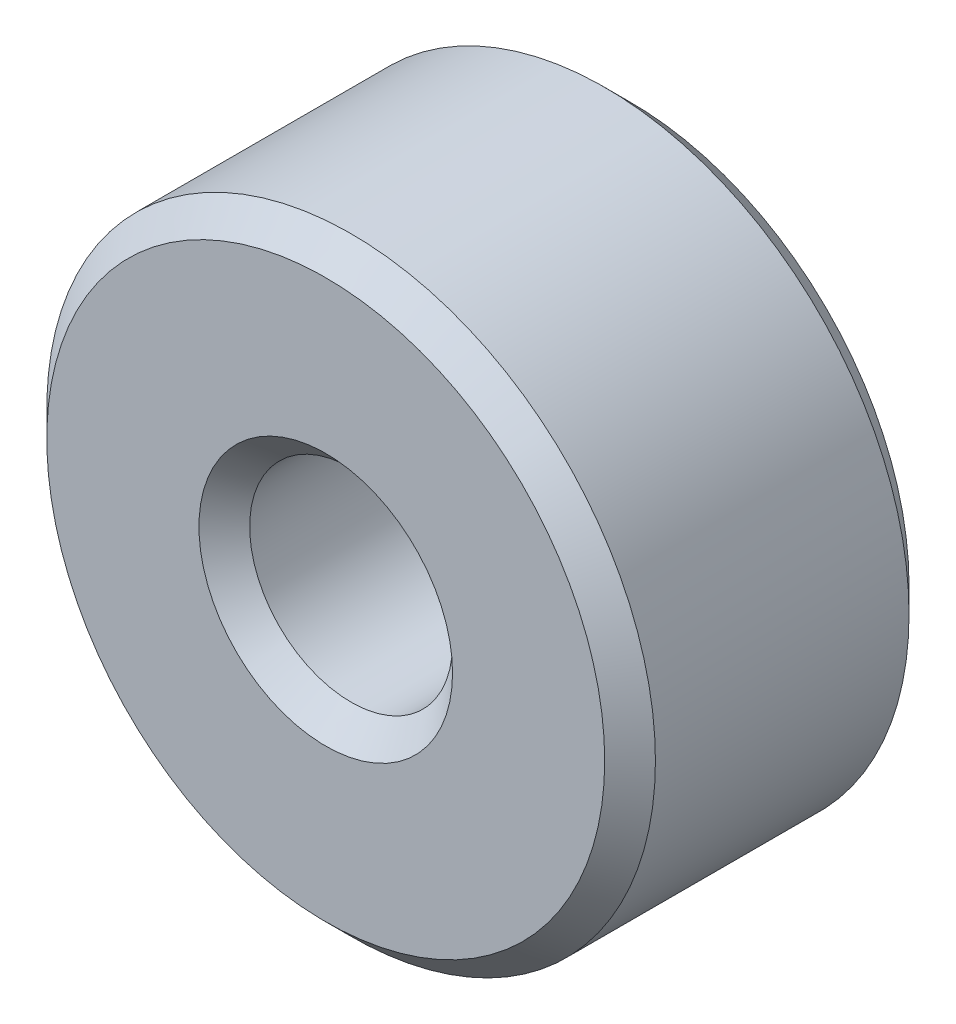
ISO-10303-21;
HEADER;
FILE_DESCRIPTION(('STEP AP214'),'2;1');
FILE_NAME('part.step','',(''),(''),'','','');
FILE_SCHEMA(('AUTOMOTIVE_DESIGN { 1 0 10303 214 1 1 1 1 }'));
ENDSEC;
DATA;
#1=APPLICATION_CONTEXT('core data for automotive mechanical design processes');
#2=APPLICATION_PROTOCOL_DEFINITION('international standard','automotive_design',2000,#1);
#3=PRODUCT_CONTEXT('',#1,'mechanical');
#4=PRODUCT('Part','Part','',(#3));
#5=PRODUCT_RELATED_PRODUCT_CATEGORY('part','',(#4));
#6=PRODUCT_DEFINITION_FORMATION('','',#4);
#7=PRODUCT_DEFINITION_CONTEXT('part definition',#1,'design');
#8=PRODUCT_DEFINITION('design','',#6,#7);
#9=PRODUCT_DEFINITION_SHAPE('','',#8);
#10=(LENGTH_UNIT() NAMED_UNIT(*) SI_UNIT(.MILLI.,.METRE.));
#11=(NAMED_UNIT(*) PLANE_ANGLE_UNIT() SI_UNIT($,.RADIAN.));
#12=(NAMED_UNIT(*) SI_UNIT($,.STERADIAN.) SOLID_ANGLE_UNIT());
#13=UNCERTAINTY_MEASURE_WITH_UNIT(LENGTH_MEASURE(1.E-05),#10,'distance_accuracy_value','');
#14=(GEOMETRIC_REPRESENTATION_CONTEXT(3) GLOBAL_UNCERTAINTY_ASSIGNED_CONTEXT((#13)) GLOBAL_UNIT_ASSIGNED_CONTEXT((#10,
#11,#12)) REPRESENTATION_CONTEXT('',''));
#15=CARTESIAN_POINT('',(0.,0.,0.));
#16=DIRECTION('',(0.,0.,1.));
#17=DIRECTION('',(1.,0.,0.));
#18=AXIS2_PLACEMENT_3D('',#15,#16,#17);
#19=CARTESIAN_POINT('',(0.,0.,16.5));
#20=DIRECTION('',(0.,0.,1.));
#21=DIRECTION('',(1.,0.,0.));
#22=AXIS2_PLACEMENT_3D('',#19,#20,#21);
#23=PLANE('',#22);
#24=CARTESIAN_POINT('',(0.,0.,16.5));
#25=DIRECTION('',(0.,0.,1.));
#26=DIRECTION('',(1.,0.,0.));
#27=AXIS2_PLACEMENT_3D('',#24,#25,#26);
#28=CIRCLE('',#27,12.5);
#29=CARTESIAN_POINT('',(12.5,0.,16.5));
#30=VERTEX_POINT('',#29);
#31=EDGE_CURVE('E11',#30,#30,#28,.F.);
#32=ORIENTED_EDGE('',*,*,#31,.T.);
#33=EDGE_LOOP('',(#32));
#34=FACE_BOUND('',#33,.T.);
#35=CARTESIAN_POINT('',(0.,0.,16.5));
#36=DIRECTION('',(0.,0.,1.));
#37=DIRECTION('',(1.,0.,0.));
#38=AXIS2_PLACEMENT_3D('',#35,#36,#37);
#39=CIRCLE('',#38,27.5);
#40=CARTESIAN_POINT('',(27.5,0.,16.5));
#41=VERTEX_POINT('',#40);
#42=EDGE_CURVE('E53',#41,#41,#39,.T.);
#43=ORIENTED_EDGE('',*,*,#42,.T.);
#44=EDGE_LOOP('',(#43));
#45=FACE_BOUND('',#44,.T.);
#46=ADVANCED_FACE('F46',(#34,#45),#23,.T.);
#47=CARTESIAN_POINT('',(0.,0.,-13.5));
#48=DIRECTION('',(0.,0.,1.));
#49=DIRECTION('',(1.,0.,0.));
#50=AXIS2_PLACEMENT_3D('',#47,#48,#49);
#51=PLANE('',#50);
#52=CARTESIAN_POINT('',(0.,0.,-13.5));
#53=DIRECTION('',(0.,0.,1.));
#54=DIRECTION('',(1.,0.,0.));
#55=AXIS2_PLACEMENT_3D('',#52,#53,#54);
#56=CIRCLE('',#55,12.5);
#57=CARTESIAN_POINT('',(12.5,0.,-13.5));
#58=VERTEX_POINT('',#57);
#59=EDGE_CURVE('E72',#58,#58,#56,.T.);
#60=ORIENTED_EDGE('',*,*,#59,.T.);
#61=EDGE_LOOP('',(#60));
#62=FACE_BOUND('',#61,.T.);
#63=CARTESIAN_POINT('',(0.,0.,-13.5));
#64=DIRECTION('',(0.,0.,1.));
#65=DIRECTION('',(1.,0.,0.));
#66=AXIS2_PLACEMENT_3D('',#63,#64,#65);
#67=CIRCLE('',#66,27.5);
#68=CARTESIAN_POINT('',(27.5,0.,-13.5));
#69=VERTEX_POINT('',#68);
#70=EDGE_CURVE('E75',#69,#69,#67,.F.);
#71=ORIENTED_EDGE('',*,*,#70,.T.);
#72=EDGE_LOOP('',(#71));
#73=FACE_BOUND('',#72,.T.);
#74=ADVANCED_FACE('F79',(#62,#73),#51,.F.);
#75=CARTESIAN_POINT('',(0.,0.,16.5));
#76=DIRECTION('',(0.,0.,-1.));
#77=DIRECTION('',(-1.,0.,0.));
#78=AXIS2_PLACEMENT_3D('',#75,#76,#77);
#79=CYLINDRICAL_SURFACE('',#78,30.);
#80=CARTESIAN_POINT('',(0.,0.,-11.));
#81=DIRECTION('',(0.,0.,1.));
#82=DIRECTION('',(1.,0.,0.));
#83=AXIS2_PLACEMENT_3D('',#80,#81,#82);
#84=CIRCLE('',#83,30.);
#85=CARTESIAN_POINT('',(30.,0.,-11.));
#86=VERTEX_POINT('',#85);
#87=EDGE_CURVE('E57',#86,#86,#84,.T.);
#88=ORIENTED_EDGE('',*,*,#87,.T.);
#89=EDGE_LOOP('',(#88));
#90=FACE_BOUND('',#89,.T.);
#91=CARTESIAN_POINT('',(0.,0.,14.));
#92=DIRECTION('',(0.,0.,1.));
#93=DIRECTION('',(1.,0.,0.));
#94=AXIS2_PLACEMENT_3D('',#91,#92,#93);
#95=CIRCLE('',#94,30.);
#96=CARTESIAN_POINT('',(30.,0.,14.));
#97=VERTEX_POINT('',#96);
#98=EDGE_CURVE('E61',#97,#97,#95,.F.);
#99=ORIENTED_EDGE('',*,*,#98,.T.);
#100=EDGE_LOOP('',(#99));
#101=FACE_BOUND('',#100,.T.);
#102=ADVANCED_FACE('F89',(#90,#101),#79,.T.);
#103=CARTESIAN_POINT('',(0.,0.,16.5));
#104=DIRECTION('',(0.,0.,-1.));
#105=DIRECTION('',(-1.,0.,0.));
#106=AXIS2_PLACEMENT_3D('',#103,#104,#105);
#107=CYLINDRICAL_SURFACE('',#106,10.);
#108=CARTESIAN_POINT('',(0.,0.,-11.));
#109=DIRECTION('',(0.,0.,1.));
#110=DIRECTION('',(1.,0.,0.));
#111=AXIS2_PLACEMENT_3D('',#108,#109,#110);
#112=CIRCLE('',#111,10.);
#113=CARTESIAN_POINT('',(10.,0.,-11.));
#114=VERTEX_POINT('',#113);
#115=EDGE_CURVE('E66',#114,#114,#112,.F.);
#116=ORIENTED_EDGE('',*,*,#115,.T.);
#117=EDGE_LOOP('',(#116));
#118=FACE_BOUND('',#117,.T.);
#119=CARTESIAN_POINT('',(0.,0.,14.));
#120=DIRECTION('',(0.,0.,1.));
#121=DIRECTION('',(1.,0.,0.));
#122=AXIS2_PLACEMENT_3D('',#119,#120,#121);
#123=CIRCLE('',#122,10.);
#124=CARTESIAN_POINT('',(10.,0.,14.));
#125=VERTEX_POINT('',#124);
#126=EDGE_CURVE('E69',#125,#125,#123,.T.);
#127=ORIENTED_EDGE('',*,*,#126,.T.);
#128=EDGE_LOOP('',(#127));
#129=FACE_BOUND('',#128,.T.);
#130=ADVANCED_FACE('F92',(#118,#129),#107,.F.);
#131=CARTESIAN_POINT('',(0.,0.,-13.5));
#132=DIRECTION('',(0.,0.,-1.));
#133=DIRECTION('',(-1.,0.,0.));
#134=AXIS2_PLACEMENT_3D('',#131,#132,#133);
#135=CONICAL_SURFACE('',#134,12.5,0.785398163397447);
#136=ORIENTED_EDGE('',*,*,#115,.F.);
#137=EDGE_LOOP('',(#136));
#138=FACE_BOUND('',#137,.T.);
#139=ORIENTED_EDGE('',*,*,#59,.F.);
#140=EDGE_LOOP('',(#139));
#141=FACE_BOUND('',#140,.T.);
#142=ADVANCED_FACE('F85',(#138,#141),#135,.F.);
#143=CARTESIAN_POINT('',(0.,0.,-11.));
#144=DIRECTION('',(0.,0.,1.));
#145=DIRECTION('',(1.,0.,0.));
#146=AXIS2_PLACEMENT_3D('',#143,#144,#145);
#147=CONICAL_SURFACE('',#146,30.,0.78539816339745);
#148=ORIENTED_EDGE('',*,*,#70,.F.);
#149=EDGE_LOOP('',(#148));
#150=FACE_BOUND('',#149,.T.);
#151=ORIENTED_EDGE('',*,*,#87,.F.);
#152=EDGE_LOOP('',(#151));
#153=FACE_BOUND('',#152,.T.);
#154=ADVANCED_FACE('F81',(#150,#153),#147,.T.);
#155=CARTESIAN_POINT('',(0.,0.,14.));
#156=DIRECTION('',(0.,0.,1.));
#157=DIRECTION('',(1.,0.,0.));
#158=AXIS2_PLACEMENT_3D('',#155,#156,#157);
#159=CONICAL_SURFACE('',#158,10.,0.78539816339745);
#160=ORIENTED_EDGE('',*,*,#31,.F.);
#161=EDGE_LOOP('',(#160));
#162=FACE_BOUND('',#161,.T.);
#163=ORIENTED_EDGE('',*,*,#126,.F.);
#164=EDGE_LOOP('',(#163));
#165=FACE_BOUND('',#164,.T.);
#166=ADVANCED_FACE('F84',(#162,#165),#159,.F.);
#167=CARTESIAN_POINT('',(0.,0.,16.5));
#168=DIRECTION('',(0.,0.,-1.));
#169=DIRECTION('',(-1.,0.,0.));
#170=AXIS2_PLACEMENT_3D('',#167,#168,#169);
#171=CONICAL_SURFACE('',#170,27.5,0.785398163397447);
#172=ORIENTED_EDGE('',*,*,#98,.F.);
#173=EDGE_LOOP('',(#172));
#174=FACE_BOUND('',#173,.T.);
#175=ORIENTED_EDGE('',*,*,#42,.F.);
#176=EDGE_LOOP('',(#175));
#177=FACE_BOUND('',#176,.T.);
#178=ADVANCED_FACE('F48',(#174,#177),#171,.T.);
#179=CLOSED_SHELL('',(#46,#74,#102,#130,#142,#154,#166,#178));
#180=MANIFOLD_SOLID_BREP('B2',#179);
#181=ADVANCED_BREP_SHAPE_REPRESENTATION('',(#18,#180),#14);
#182=SHAPE_DEFINITION_REPRESENTATION(#9,#181);
ENDSEC;
END-ISO-10303-21;
